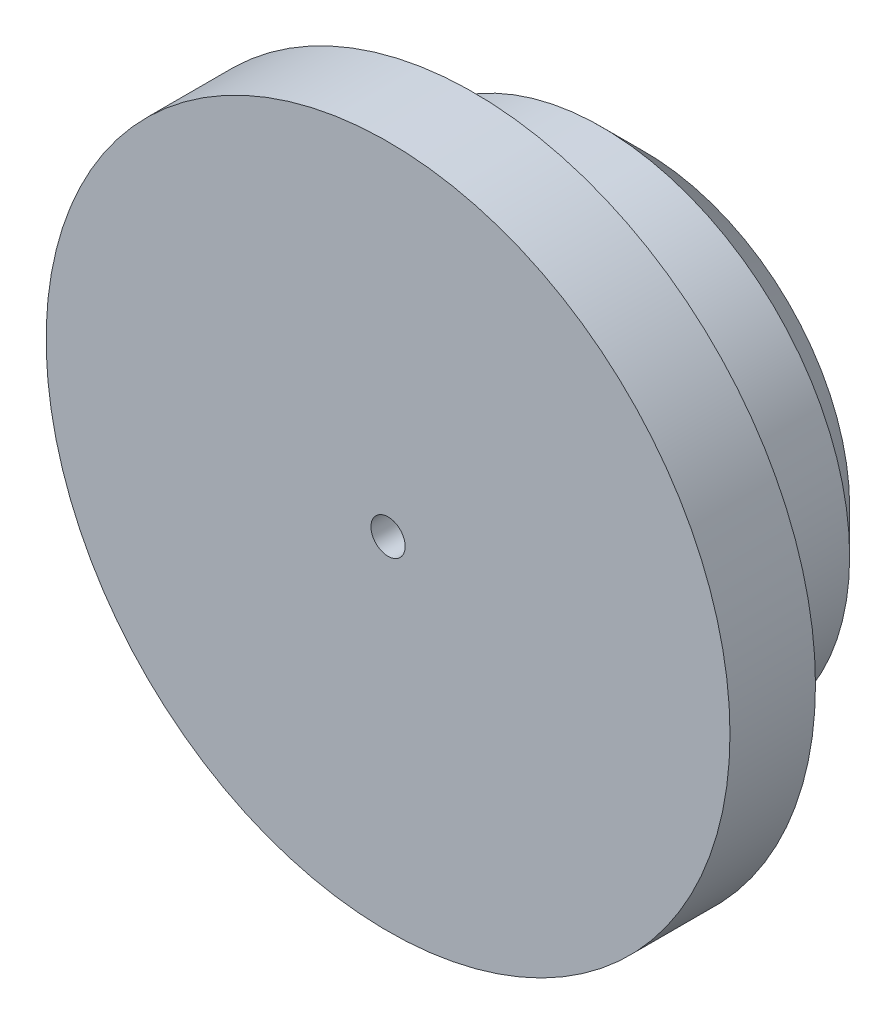
ISO-10303-21;
HEADER;
FILE_DESCRIPTION(('STEP AP214'),'2;1');
FILE_NAME('part.step','',(''),(''),'','','');
FILE_SCHEMA(('AUTOMOTIVE_DESIGN { 1 0 10303 214 1 1 1 1 }'));
ENDSEC;
DATA;
#1=APPLICATION_CONTEXT('core data for automotive mechanical design processes');
#2=APPLICATION_PROTOCOL_DEFINITION('international standard','automotive_design',2000,#1);
#3=PRODUCT_CONTEXT('',#1,'mechanical');
#4=PRODUCT('Part','Part','',(#3));
#5=PRODUCT_RELATED_PRODUCT_CATEGORY('part','',(#4));
#6=PRODUCT_DEFINITION_FORMATION('','',#4);
#7=PRODUCT_DEFINITION_CONTEXT('part definition',#1,'design');
#8=PRODUCT_DEFINITION('design','',#6,#7);
#9=PRODUCT_DEFINITION_SHAPE('','',#8);
#10=(LENGTH_UNIT() NAMED_UNIT(*) SI_UNIT(.MILLI.,.METRE.));
#11=(NAMED_UNIT(*) PLANE_ANGLE_UNIT() SI_UNIT($,.RADIAN.));
#12=(NAMED_UNIT(*) SI_UNIT($,.STERADIAN.) SOLID_ANGLE_UNIT());
#13=UNCERTAINTY_MEASURE_WITH_UNIT(LENGTH_MEASURE(1.E-05),#10,'distance_accuracy_value','');
#14=(GEOMETRIC_REPRESENTATION_CONTEXT(3) GLOBAL_UNCERTAINTY_ASSIGNED_CONTEXT((#13)) GLOBAL_UNIT_ASSIGNED_CONTEXT((#10,
#11,#12)) REPRESENTATION_CONTEXT('',''));
#15=CARTESIAN_POINT('',(0.,0.,0.));
#16=DIRECTION('',(0.,0.,1.));
#17=DIRECTION('',(1.,0.,0.));
#18=AXIS2_PLACEMENT_3D('',#15,#16,#17);
#19=CARTESIAN_POINT('',(0.,0.,0.));
#20=DIRECTION('',(0.,0.,1.));
#21=DIRECTION('',(1.,0.,0.));
#22=AXIS2_PLACEMENT_3D('',#19,#20,#21);
#23=PLANE('',#22);
#24=DIRECTION('',(0.,1.,0.));
#25=VECTOR('',#24,1.);
#26=CARTESIAN_POINT('',(-2.5,3.,0.));
#27=LINE('',#26,#25);
#28=CARTESIAN_POINT('',(-2.5,3.,0.));
#29=VERTEX_POINT('',#28);
#30=CARTESIAN_POINT('',(-2.5,10.,0.));
#31=VERTEX_POINT('',#30);
#32=EDGE_CURVE('E132',#29,#31,#27,.T.);
#33=ORIENTED_EDGE('',*,*,#32,.F.);
#34=DIRECTION('',(-1.,0.,0.));
#35=VECTOR('',#34,1.);
#36=CARTESIAN_POINT('',(2.5,3.,0.));
#37=LINE('',#36,#35);
#38=CARTESIAN_POINT('',(2.5,3.,0.));
#39=VERTEX_POINT('',#38);
#40=EDGE_CURVE('E148',#39,#29,#37,.T.);
#41=ORIENTED_EDGE('',*,*,#40,.F.);
#42=DIRECTION('',(0.,-1.,0.));
#43=VECTOR('',#42,1.);
#44=CARTESIAN_POINT('',(2.5,10.,0.));
#45=LINE('',#44,#43);
#46=CARTESIAN_POINT('',(2.5,10.,0.));
#47=VERTEX_POINT('',#46);
#48=EDGE_CURVE('E161',#47,#39,#45,.T.);
#49=ORIENTED_EDGE('',*,*,#48,.F.);
#50=DIRECTION('',(1.,0.,0.));
#51=VECTOR('',#50,1.);
#52=CARTESIAN_POINT('',(-2.5,10.,0.));
#53=LINE('',#52,#51);
#54=EDGE_CURVE('E137',#31,#47,#53,.T.);
#55=ORIENTED_EDGE('',*,*,#54,.F.);
#56=EDGE_LOOP('',(#33,#41,#49,#55));
#57=FACE_BOUND('',#56,.T.);
#58=CARTESIAN_POINT('',(0.,0.,0.));
#59=DIRECTION('',(0.,0.,1.));
#60=DIRECTION('',(1.,0.,0.));
#61=AXIS2_PLACEMENT_3D('',#58,#59,#60);
#62=CIRCLE('',#61,2.);
#63=CARTESIAN_POINT('',(2.,0.,0.));
#64=VERTEX_POINT('',#63);
#65=EDGE_CURVE('E187',#64,#64,#62,.F.);
#66=ORIENTED_EDGE('',*,*,#65,.F.);
#67=EDGE_LOOP('',(#66));
#68=FACE_BOUND('',#67,.T.);
#69=CARTESIAN_POINT('',(0.,0.,0.));
#70=DIRECTION('',(0.,0.,1.));
#71=DIRECTION('',(1.,0.,0.));
#72=AXIS2_PLACEMENT_3D('',#69,#70,#71);
#73=CIRCLE('',#72,24.);
#74=CARTESIAN_POINT('',(24.,0.,0.));
#75=VERTEX_POINT('',#74);
#76=EDGE_CURVE('E11',#75,#75,#73,.F.);
#77=ORIENTED_EDGE('',*,*,#76,.T.);
#78=EDGE_LOOP('',(#77));
#79=FACE_BOUND('',#78,.T.);
#80=DIRECTION('',(0.,-1.,0.));
#81=VECTOR('',#80,1.);
#82=CARTESIAN_POINT('',(2.5,-3.,0.));
#83=LINE('',#82,#81);
#84=CARTESIAN_POINT('',(2.5,-3.,0.));
#85=VERTEX_POINT('',#84);
#86=CARTESIAN_POINT('',(2.5,-10.,0.));
#87=VERTEX_POINT('',#86);
#88=EDGE_CURVE('E130',#85,#87,#83,.T.);
#89=ORIENTED_EDGE('',*,*,#88,.F.);
#90=DIRECTION('',(1.,0.,0.));
#91=VECTOR('',#90,1.);
#92=CARTESIAN_POINT('',(2.5,-3.,0.));
#93=LINE('',#92,#91);
#94=CARTESIAN_POINT('',(-2.5,-3.,0.));
#95=VERTEX_POINT('',#94);
#96=EDGE_CURVE('E127',#95,#85,#93,.T.);
#97=ORIENTED_EDGE('',*,*,#96,.F.);
#98=DIRECTION('',(0.,1.,0.));
#99=VECTOR('',#98,1.);
#100=CARTESIAN_POINT('',(-2.5,-3.,0.));
#101=LINE('',#100,#99);
#102=CARTESIAN_POINT('',(-2.5,-10.,0.));
#103=VERTEX_POINT('',#102);
#104=EDGE_CURVE('E63',#103,#95,#101,.T.);
#105=ORIENTED_EDGE('',*,*,#104,.F.);
#106=DIRECTION('',(-1.,0.,0.));
#107=VECTOR('',#106,1.);
#108=CARTESIAN_POINT('',(2.5,-10.,0.));
#109=LINE('',#108,#107);
#110=EDGE_CURVE('E58',#87,#103,#109,.T.);
#111=ORIENTED_EDGE('',*,*,#110,.F.);
#112=EDGE_LOOP('',(#89,#97,#105,#111));
#113=FACE_BOUND('',#112,.T.);
#114=ADVANCED_FACE('F41',(#57,#68,#79,#113),#23,.F.);
#115=CARTESIAN_POINT('',(0.,0.,20.));
#116=DIRECTION('',(0.,0.,-1.));
#117=DIRECTION('',(-1.,0.,0.));
#118=AXIS2_PLACEMENT_3D('',#115,#116,#117);
#119=CYLINDRICAL_SURFACE('',#118,29.);
#120=CARTESIAN_POINT('',(0.,0.,5.00000000000001));
#121=DIRECTION('',(0.,0.,1.));
#122=DIRECTION('',(1.,0.,0.));
#123=AXIS2_PLACEMENT_3D('',#120,#121,#122);
#124=CIRCLE('',#123,29.);
#125=CARTESIAN_POINT('',(29.,0.,5.00000000000001));
#126=VERTEX_POINT('',#125);
#127=EDGE_CURVE('E51',#126,#126,#124,.T.);
#128=ORIENTED_EDGE('',*,*,#127,.T.);
#129=EDGE_LOOP('',(#128));
#130=FACE_BOUND('',#129,.T.);
#131=CARTESIAN_POINT('',(0.,0.,20.));
#132=DIRECTION('',(0.,0.,1.));
#133=DIRECTION('',(1.,0.,0.));
#134=AXIS2_PLACEMENT_3D('',#131,#132,#133);
#135=CIRCLE('',#134,29.);
#136=CARTESIAN_POINT('',(29.,0.,20.));
#137=VERTEX_POINT('',#136);
#138=EDGE_CURVE('E196',#137,#137,#135,.T.);
#139=ORIENTED_EDGE('',*,*,#138,.F.);
#140=EDGE_LOOP('',(#139));
#141=FACE_BOUND('',#140,.T.);
#142=ADVANCED_FACE('F206',(#130,#141),#119,.T.);
#143=CARTESIAN_POINT('',(0.,0.,30.));
#144=DIRECTION('',(0.,0.,-1.));
#145=DIRECTION('',(-1.,0.,0.));
#146=AXIS2_PLACEMENT_3D('',#143,#144,#145);
#147=CYLINDRICAL_SURFACE('',#146,40.);
#148=CARTESIAN_POINT('',(0.,0.,30.));
#149=DIRECTION('',(0.,0.,1.));
#150=DIRECTION('',(1.,0.,0.));
#151=AXIS2_PLACEMENT_3D('',#148,#149,#150);
#152=CIRCLE('',#151,40.);
#153=CARTESIAN_POINT('',(40.,0.,30.));
#154=VERTEX_POINT('',#153);
#155=EDGE_CURVE('E192',#154,#154,#152,.T.);
#156=ORIENTED_EDGE('',*,*,#155,.F.);
#157=EDGE_LOOP('',(#156));
#158=FACE_BOUND('',#157,.T.);
#159=CARTESIAN_POINT('',(0.,0.,20.));
#160=DIRECTION('',(0.,0.,1.));
#161=DIRECTION('',(1.,0.,0.));
#162=AXIS2_PLACEMENT_3D('',#159,#160,#161);
#163=CIRCLE('',#162,40.);
#164=CARTESIAN_POINT('',(40.,0.,20.));
#165=VERTEX_POINT('',#164);
#166=EDGE_CURVE('E191',#165,#165,#163,.T.);
#167=ORIENTED_EDGE('',*,*,#166,.T.);
#168=EDGE_LOOP('',(#167));
#169=FACE_BOUND('',#168,.T.);
#170=ADVANCED_FACE('F230',(#158,#169),#147,.T.);
#171=CARTESIAN_POINT('',(0.,0.,30.));
#172=DIRECTION('',(0.,0.,1.));
#173=DIRECTION('',(1.,0.,0.));
#174=AXIS2_PLACEMENT_3D('',#171,#172,#173);
#175=PLANE('',#174);
#176=CARTESIAN_POINT('',(0.,0.,30.));
#177=DIRECTION('',(0.,0.,1.));
#178=DIRECTION('',(1.,0.,0.));
#179=AXIS2_PLACEMENT_3D('',#176,#177,#178);
#180=CIRCLE('',#179,2.);
#181=CARTESIAN_POINT('',(2.,0.,30.));
#182=VERTEX_POINT('',#181);
#183=EDGE_CURVE('E183',#182,#182,#180,.T.);
#184=ORIENTED_EDGE('',*,*,#183,.F.);
#185=EDGE_LOOP('',(#184));
#186=FACE_BOUND('',#185,.T.);
#187=ORIENTED_EDGE('',*,*,#155,.T.);
#188=EDGE_LOOP('',(#187));
#189=FACE_BOUND('',#188,.T.);
#190=ADVANCED_FACE('F220',(#186,#189),#175,.T.);
#191=CARTESIAN_POINT('',(0.,0.,20.));
#192=DIRECTION('',(0.,0.,1.));
#193=DIRECTION('',(1.,0.,0.));
#194=AXIS2_PLACEMENT_3D('',#191,#192,#193);
#195=PLANE('',#194);
#196=ORIENTED_EDGE('',*,*,#138,.T.);
#197=EDGE_LOOP('',(#196));
#198=FACE_BOUND('',#197,.T.);
#199=ORIENTED_EDGE('',*,*,#166,.F.);
#200=EDGE_LOOP('',(#199));
#201=FACE_BOUND('',#200,.T.);
#202=ADVANCED_FACE('F211',(#198,#201),#195,.F.);
#203=CARTESIAN_POINT('',(0.,0.,5.00000000000001));
#204=DIRECTION('',(0.,0.,1.));
#205=DIRECTION('',(1.,0.,0.));
#206=AXIS2_PLACEMENT_3D('',#203,#204,#205);
#207=CONICAL_SURFACE('',#206,29.,0.785398163397451);
#208=ORIENTED_EDGE('',*,*,#76,.F.);
#209=EDGE_LOOP('',(#208));
#210=FACE_BOUND('',#209,.T.);
#211=ORIENTED_EDGE('',*,*,#127,.F.);
#212=EDGE_LOOP('',(#211));
#213=FACE_BOUND('',#212,.T.);
#214=ADVANCED_FACE('F44',(#210,#213),#207,.T.);
#215=CARTESIAN_POINT('',(0.,0.,-5.65685424949237));
#216=DIRECTION('',(0.,0.,1.));
#217=DIRECTION('',(1.,0.,0.));
#218=AXIS2_PLACEMENT_3D('',#215,#216,#217);
#219=CYLINDRICAL_SURFACE('',#218,2.);
#220=ORIENTED_EDGE('',*,*,#65,.T.);
#221=EDGE_LOOP('',(#220));
#222=FACE_BOUND('',#221,.T.);
#223=ORIENTED_EDGE('',*,*,#183,.T.);
#224=EDGE_LOOP('',(#223));
#225=FACE_BOUND('',#224,.T.);
#226=ADVANCED_FACE('F210',(#222,#225),#219,.F.);
#227=CARTESIAN_POINT('',(-2.5,3.,-10.));
#228=DIRECTION('',(1.,0.,0.));
#229=DIRECTION('',(0.,0.,-1.));
#230=AXIS2_PLACEMENT_3D('',#227,#228,#229);
#231=PLANE('',#230);
#232=ORIENTED_EDGE('',*,*,#32,.T.);
#233=DIRECTION('',(0.,0.,1.));
#234=VECTOR('',#233,1.);
#235=CARTESIAN_POINT('',(-2.5,10.,-10.));
#236=LINE('',#235,#234);
#237=CARTESIAN_POINT('',(-2.5,10.,-10.));
#238=VERTEX_POINT('',#237);
#239=EDGE_CURVE('E179',#238,#31,#236,.T.);
#240=ORIENTED_EDGE('',*,*,#239,.F.);
#241=DIRECTION('',(0.,1.,0.));
#242=VECTOR('',#241,1.);
#243=CARTESIAN_POINT('',(-2.5,3.,-10.));
#244=LINE('',#243,#242);
#245=CARTESIAN_POINT('',(-2.5,3.,-10.));
#246=VERTEX_POINT('',#245);
#247=EDGE_CURVE('E143',#246,#238,#244,.T.);
#248=ORIENTED_EDGE('',*,*,#247,.F.);
#249=DIRECTION('',(0.,0.,1.));
#250=VECTOR('',#249,1.);
#251=CARTESIAN_POINT('',(-2.5,3.,-10.));
#252=LINE('',#251,#250);
#253=EDGE_CURVE('E156',#246,#29,#252,.T.);
#254=ORIENTED_EDGE('',*,*,#253,.T.);
#255=EDGE_LOOP('',(#232,#240,#248,#254));
#256=FACE_BOUND('',#255,.T.);
#257=ADVANCED_FACE('F217',(#256),#231,.F.);
#258=CARTESIAN_POINT('',(-2.5,10.,-10.));
#259=DIRECTION('',(0.,-1.,0.));
#260=DIRECTION('',(0.,0.,-1.));
#261=AXIS2_PLACEMENT_3D('',#258,#259,#260);
#262=PLANE('',#261);
#263=ORIENTED_EDGE('',*,*,#54,.T.);
#264=DIRECTION('',(0.,0.,1.));
#265=VECTOR('',#264,1.);
#266=CARTESIAN_POINT('',(2.5,10.,-10.));
#267=LINE('',#266,#265);
#268=CARTESIAN_POINT('',(2.5,10.,-10.));
#269=VERTEX_POINT('',#268);
#270=EDGE_CURVE('E175',#269,#47,#267,.T.);
#271=ORIENTED_EDGE('',*,*,#270,.F.);
#272=DIRECTION('',(1.,0.,0.));
#273=VECTOR('',#272,1.);
#274=CARTESIAN_POINT('',(-2.5,10.,-10.));
#275=LINE('',#274,#273);
#276=EDGE_CURVE('E147',#238,#269,#275,.T.);
#277=ORIENTED_EDGE('',*,*,#276,.F.);
#278=ORIENTED_EDGE('',*,*,#239,.T.);
#279=EDGE_LOOP('',(#263,#271,#277,#278));
#280=FACE_BOUND('',#279,.T.);
#281=ADVANCED_FACE('F241',(#280),#262,.F.);
#282=CARTESIAN_POINT('',(2.5,10.,-10.));
#283=DIRECTION('',(-1.,0.,0.));
#284=DIRECTION('',(0.,-1.,0.));
#285=AXIS2_PLACEMENT_3D('',#282,#283,#284);
#286=PLANE('',#285);
#287=ORIENTED_EDGE('',*,*,#48,.T.);
#288=DIRECTION('',(0.,0.,1.));
#289=VECTOR('',#288,1.);
#290=CARTESIAN_POINT('',(2.5,3.,-10.));
#291=LINE('',#290,#289);
#292=CARTESIAN_POINT('',(2.5,3.,-10.));
#293=VERTEX_POINT('',#292);
#294=EDGE_CURVE('E171',#293,#39,#291,.T.);
#295=ORIENTED_EDGE('',*,*,#294,.F.);
#296=DIRECTION('',(0.,-1.,0.));
#297=VECTOR('',#296,1.);
#298=CARTESIAN_POINT('',(2.5,10.,-10.));
#299=LINE('',#298,#297);
#300=EDGE_CURVE('E151',#269,#293,#299,.T.);
#301=ORIENTED_EDGE('',*,*,#300,.F.);
#302=ORIENTED_EDGE('',*,*,#270,.T.);
#303=EDGE_LOOP('',(#287,#295,#301,#302));
#304=FACE_BOUND('',#303,.T.);
#305=ADVANCED_FACE('F245',(#304),#286,.F.);
#306=CARTESIAN_POINT('',(2.5,3.,-10.));
#307=DIRECTION('',(0.,1.,0.));
#308=DIRECTION('',(-1.,0.,0.));
#309=AXIS2_PLACEMENT_3D('',#306,#307,#308);
#310=PLANE('',#309);
#311=ORIENTED_EDGE('',*,*,#40,.T.);
#312=ORIENTED_EDGE('',*,*,#253,.F.);
#313=DIRECTION('',(-1.,0.,0.));
#314=VECTOR('',#313,1.);
#315=CARTESIAN_POINT('',(2.5,3.,-10.));
#316=LINE('',#315,#314);
#317=EDGE_CURVE('E154',#293,#246,#316,.T.);
#318=ORIENTED_EDGE('',*,*,#317,.F.);
#319=ORIENTED_EDGE('',*,*,#294,.T.);
#320=EDGE_LOOP('',(#311,#312,#318,#319));
#321=FACE_BOUND('',#320,.T.);
#322=ADVANCED_FACE('F249',(#321),#310,.F.);
#323=CARTESIAN_POINT('',(0.,0.,-10.));
#324=DIRECTION('',(0.,0.,-1.));
#325=DIRECTION('',(-1.,0.,0.));
#326=AXIS2_PLACEMENT_3D('',#323,#324,#325);
#327=PLANE('',#326);
#328=ORIENTED_EDGE('',*,*,#247,.T.);
#329=ORIENTED_EDGE('',*,*,#276,.T.);
#330=ORIENTED_EDGE('',*,*,#300,.T.);
#331=ORIENTED_EDGE('',*,*,#317,.T.);
#332=EDGE_LOOP('',(#328,#329,#330,#331));
#333=FACE_BOUND('',#332,.T.);
#334=ADVANCED_FACE('F253',(#333),#327,.T.);
#335=CARTESIAN_POINT('',(2.5,-3.,-10.));
#336=DIRECTION('',(-1.,0.,0.));
#337=DIRECTION('',(0.,-1.,0.));
#338=AXIS2_PLACEMENT_3D('',#335,#336,#337);
#339=PLANE('',#338);
#340=ORIENTED_EDGE('',*,*,#88,.T.);
#341=DIRECTION('',(0.,0.,1.));
#342=VECTOR('',#341,1.);
#343=CARTESIAN_POINT('',(2.5,-10.,-10.));
#344=LINE('',#343,#342);
#345=CARTESIAN_POINT('',(2.5,-10.,-10.));
#346=VERTEX_POINT('',#345);
#347=EDGE_CURVE('E109',#346,#87,#344,.T.);
#348=ORIENTED_EDGE('',*,*,#347,.F.);
#349=DIRECTION('',(0.,-1.,0.));
#350=VECTOR('',#349,1.);
#351=CARTESIAN_POINT('',(2.5,-3.,-10.));
#352=LINE('',#351,#350);
#353=CARTESIAN_POINT('',(2.5,-3.,-10.));
#354=VERTEX_POINT('',#353);
#355=EDGE_CURVE('E117',#354,#346,#352,.T.);
#356=ORIENTED_EDGE('',*,*,#355,.F.);
#357=DIRECTION('',(0.,0.,1.));
#358=VECTOR('',#357,1.);
#359=CARTESIAN_POINT('',(2.5,-3.,-10.));
#360=LINE('',#359,#358);
#361=EDGE_CURVE('E371',#354,#85,#360,.T.);
#362=ORIENTED_EDGE('',*,*,#361,.T.);
#363=EDGE_LOOP('',(#340,#348,#356,#362));
#364=FACE_BOUND('',#363,.T.);
#365=ADVANCED_FACE('F129',(#364),#339,.F.);
#366=CARTESIAN_POINT('',(2.5,-10.,-10.));
#367=DIRECTION('',(0.,1.,0.));
#368=DIRECTION('',(0.,0.,1.));
#369=AXIS2_PLACEMENT_3D('',#366,#367,#368);
#370=PLANE('',#369);
#371=ORIENTED_EDGE('',*,*,#110,.T.);
#372=DIRECTION('',(0.,0.,1.));
#373=VECTOR('',#372,1.);
#374=CARTESIAN_POINT('',(-2.5,-10.,-10.));
#375=LINE('',#374,#373);
#376=CARTESIAN_POINT('',(-2.5,-10.,-10.));
#377=VERTEX_POINT('',#376);
#378=EDGE_CURVE('E112',#377,#103,#375,.T.);
#379=ORIENTED_EDGE('',*,*,#378,.F.);
#380=DIRECTION('',(-1.,0.,0.));
#381=VECTOR('',#380,1.);
#382=CARTESIAN_POINT('',(2.5,-10.,-10.));
#383=LINE('',#382,#381);
#384=EDGE_CURVE('E105',#346,#377,#383,.T.);
#385=ORIENTED_EDGE('',*,*,#384,.F.);
#386=ORIENTED_EDGE('',*,*,#347,.T.);
#387=EDGE_LOOP('',(#371,#379,#385,#386));
#388=FACE_BOUND('',#387,.T.);
#389=ADVANCED_FACE('F107',(#388),#370,.F.);
#390=CARTESIAN_POINT('',(-2.5,-3.,-10.));
#391=DIRECTION('',(1.,0.,0.));
#392=DIRECTION('',(0.,0.,-1.));
#393=AXIS2_PLACEMENT_3D('',#390,#391,#392);
#394=PLANE('',#393);
#395=ORIENTED_EDGE('',*,*,#104,.T.);
#396=DIRECTION('',(0.,0.,1.));
#397=VECTOR('',#396,1.);
#398=CARTESIAN_POINT('',(-2.5,-3.,-10.));
#399=LINE('',#398,#397);
#400=CARTESIAN_POINT('',(-2.5,-3.,-10.));
#401=VERTEX_POINT('',#400);
#402=EDGE_CURVE('E139',#401,#95,#399,.T.);
#403=ORIENTED_EDGE('',*,*,#402,.F.);
#404=DIRECTION('',(0.,1.,0.));
#405=VECTOR('',#404,1.);
#406=CARTESIAN_POINT('',(-2.5,-3.,-10.));
#407=LINE('',#406,#405);
#408=EDGE_CURVE('E116',#377,#401,#407,.T.);
#409=ORIENTED_EDGE('',*,*,#408,.F.);
#410=ORIENTED_EDGE('',*,*,#378,.T.);
#411=EDGE_LOOP('',(#395,#403,#409,#410));
#412=FACE_BOUND('',#411,.T.);
#413=ADVANCED_FACE('F262',(#412),#394,.F.);
#414=CARTESIAN_POINT('',(2.5,-3.,-10.));
#415=DIRECTION('',(0.,-1.,0.));
#416=DIRECTION('',(1.,0.,0.));
#417=AXIS2_PLACEMENT_3D('',#414,#415,#416);
#418=PLANE('',#417);
#419=ORIENTED_EDGE('',*,*,#96,.T.);
#420=ORIENTED_EDGE('',*,*,#361,.F.);
#421=DIRECTION('',(1.,0.,0.));
#422=VECTOR('',#421,1.);
#423=CARTESIAN_POINT('',(2.5,-3.,-10.));
#424=LINE('',#423,#422);
#425=EDGE_CURVE('E122',#401,#354,#424,.T.);
#426=ORIENTED_EDGE('',*,*,#425,.F.);
#427=ORIENTED_EDGE('',*,*,#402,.T.);
#428=EDGE_LOOP('',(#419,#420,#426,#427));
#429=FACE_BOUND('',#428,.T.);
#430=ADVANCED_FACE('F265',(#429),#418,.F.);
#431=CARTESIAN_POINT('',(0.,0.,-10.));
#432=DIRECTION('',(0.,0.,-1.));
#433=DIRECTION('',(-1.,0.,0.));
#434=AXIS2_PLACEMENT_3D('',#431,#432,#433);
#435=PLANE('',#434);
#436=ORIENTED_EDGE('',*,*,#355,.T.);
#437=ORIENTED_EDGE('',*,*,#384,.T.);
#438=ORIENTED_EDGE('',*,*,#408,.T.);
#439=ORIENTED_EDGE('',*,*,#425,.T.);
#440=EDGE_LOOP('',(#436,#437,#438,#439));
#441=FACE_BOUND('',#440,.T.);
#442=ADVANCED_FACE('F120',(#441),#435,.T.);
#443=CLOSED_SHELL('',(#114,#142,#170,#190,#202,#214,#226,#257,#281,#305,#322,#334,#365,#389,
#413,#430,#442));
#444=MANIFOLD_SOLID_BREP('B2',#443);
#445=ADVANCED_BREP_SHAPE_REPRESENTATION('',(#18,#444),#14);
#446=SHAPE_DEFINITION_REPRESENTATION(#9,#445);
ENDSEC;
END-ISO-10303-21;
